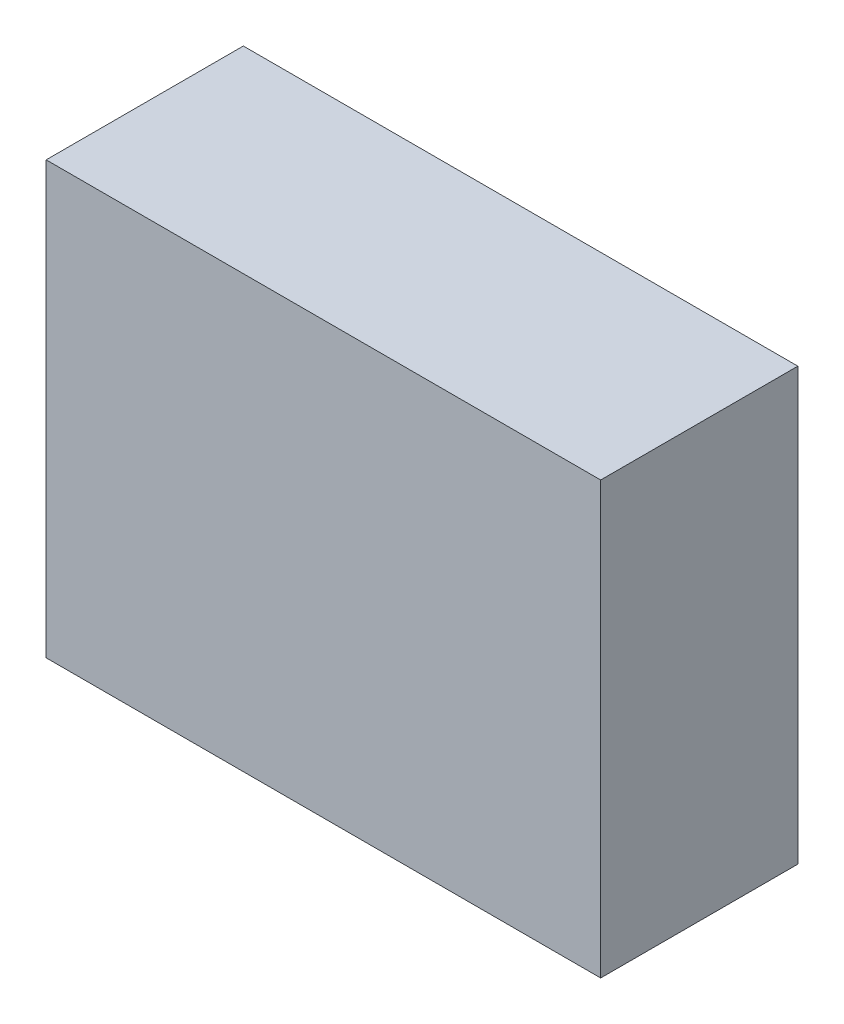
ISO-10303-21;
HEADER;
FILE_DESCRIPTION(('STEP AP214'),'2;1');
FILE_NAME('part.step','',(''),(''),'','','');
FILE_SCHEMA(('AUTOMOTIVE_DESIGN { 1 0 10303 214 1 1 1 1 }'));
ENDSEC;
DATA;
#1=APPLICATION_CONTEXT('core data for automotive mechanical design processes');
#2=APPLICATION_PROTOCOL_DEFINITION('international standard','automotive_design',2000,#1);
#3=PRODUCT_CONTEXT('',#1,'mechanical');
#4=PRODUCT('Part','Part','',(#3));
#5=PRODUCT_RELATED_PRODUCT_CATEGORY('part','',(#4));
#6=PRODUCT_DEFINITION_FORMATION('','',#4);
#7=PRODUCT_DEFINITION_CONTEXT('part definition',#1,'design');
#8=PRODUCT_DEFINITION('design','',#6,#7);
#9=PRODUCT_DEFINITION_SHAPE('','',#8);
#10=(LENGTH_UNIT() NAMED_UNIT(*) SI_UNIT(.MILLI.,.METRE.));
#11=(NAMED_UNIT(*) PLANE_ANGLE_UNIT() SI_UNIT($,.RADIAN.));
#12=(NAMED_UNIT(*) SI_UNIT($,.STERADIAN.) SOLID_ANGLE_UNIT());
#13=UNCERTAINTY_MEASURE_WITH_UNIT(LENGTH_MEASURE(1.E-05),#10,'distance_accuracy_value','');
#14=(GEOMETRIC_REPRESENTATION_CONTEXT(3) GLOBAL_UNCERTAINTY_ASSIGNED_CONTEXT((#13)) GLOBAL_UNIT_ASSIGNED_CONTEXT((#10,
#11,#12)) REPRESENTATION_CONTEXT('',''));
#15=CARTESIAN_POINT('',(0.,0.,0.));
#16=DIRECTION('',(0.,0.,1.));
#17=DIRECTION('',(1.,0.,0.));
#18=AXIS2_PLACEMENT_3D('',#15,#16,#17);
#19=CARTESIAN_POINT('',(225.,175.,160.));
#20=DIRECTION('',(-1.,0.,0.));
#21=DIRECTION('',(0.,0.,1.));
#22=AXIS2_PLACEMENT_3D('',#19,#20,#21);
#23=PLANE('',#22);
#24=DIRECTION('',(0.,1.,0.));
#25=VECTOR('',#24,1.);
#26=CARTESIAN_POINT('',(225.,175.,0.));
#27=LINE('',#26,#25);
#28=CARTESIAN_POINT('',(225.,-175.,0.));
#29=VERTEX_POINT('',#28);
#30=CARTESIAN_POINT('',(225.,175.,0.));
#31=VERTEX_POINT('',#30);
#32=EDGE_CURVE('E107',#29,#31,#27,.T.);
#33=ORIENTED_EDGE('',*,*,#32,.T.);
#34=DIRECTION('',(0.,0.,-1.));
#35=VECTOR('',#34,1.);
#36=CARTESIAN_POINT('',(225.,175.,160.));
#37=LINE('',#36,#35);
#38=CARTESIAN_POINT('',(225.,175.,160.));
#39=VERTEX_POINT('',#38);
#40=EDGE_CURVE('E11',#39,#31,#37,.T.);
#41=ORIENTED_EDGE('',*,*,#40,.F.);
#42=DIRECTION('',(0.,1.,0.));
#43=VECTOR('',#42,1.);
#44=CARTESIAN_POINT('',(225.,175.,160.));
#45=LINE('',#44,#43);
#46=CARTESIAN_POINT('',(225.,-175.,160.));
#47=VERTEX_POINT('',#46);
#48=EDGE_CURVE('E91',#47,#39,#45,.T.);
#49=ORIENTED_EDGE('',*,*,#48,.F.);
#50=DIRECTION('',(0.,0.,-1.));
#51=VECTOR('',#50,1.);
#52=CARTESIAN_POINT('',(225.,-175.,160.));
#53=LINE('',#52,#51);
#54=EDGE_CURVE('E103',#47,#29,#53,.T.);
#55=ORIENTED_EDGE('',*,*,#54,.T.);
#56=EDGE_LOOP('',(#33,#41,#49,#55));
#57=FACE_BOUND('',#56,.T.);
#58=ADVANCED_FACE('F39',(#57),#23,.F.);
#59=CARTESIAN_POINT('',(-225.,175.,160.));
#60=DIRECTION('',(0.,-1.,0.));
#61=DIRECTION('',(0.,0.,-1.));
#62=AXIS2_PLACEMENT_3D('',#59,#60,#61);
#63=PLANE('',#62);
#64=DIRECTION('',(-1.,0.,0.));
#65=VECTOR('',#64,1.);
#66=CARTESIAN_POINT('',(-225.,175.,0.));
#67=LINE('',#66,#65);
#68=CARTESIAN_POINT('',(-225.,175.,0.));
#69=VERTEX_POINT('',#68);
#70=EDGE_CURVE('E96',#31,#69,#67,.T.);
#71=ORIENTED_EDGE('',*,*,#70,.T.);
#72=DIRECTION('',(0.,0.,-1.));
#73=VECTOR('',#72,1.);
#74=CARTESIAN_POINT('',(-225.,175.,160.));
#75=LINE('',#74,#73);
#76=CARTESIAN_POINT('',(-225.,175.,160.));
#77=VERTEX_POINT('',#76);
#78=EDGE_CURVE('E48',#77,#69,#75,.T.);
#79=ORIENTED_EDGE('',*,*,#78,.F.);
#80=DIRECTION('',(-1.,0.,0.));
#81=VECTOR('',#80,1.);
#82=CARTESIAN_POINT('',(-225.,175.,160.));
#83=LINE('',#82,#81);
#84=EDGE_CURVE('E86',#39,#77,#83,.T.);
#85=ORIENTED_EDGE('',*,*,#84,.F.);
#86=ORIENTED_EDGE('',*,*,#40,.T.);
#87=EDGE_LOOP('',(#71,#79,#85,#86));
#88=FACE_BOUND('',#87,.T.);
#89=ADVANCED_FACE('F95',(#88),#63,.F.);
#90=CARTESIAN_POINT('',(-225.,175.,160.));
#91=DIRECTION('',(1.,0.,0.));
#92=DIRECTION('',(0.,0.,-1.));
#93=AXIS2_PLACEMENT_3D('',#90,#91,#92);
#94=PLANE('',#93);
#95=DIRECTION('',(0.,-1.,0.));
#96=VECTOR('',#95,1.);
#97=CARTESIAN_POINT('',(-225.,175.,0.));
#98=LINE('',#97,#96);
#99=CARTESIAN_POINT('',(-225.,-175.,0.));
#100=VERTEX_POINT('',#99);
#101=EDGE_CURVE('E73',#69,#100,#98,.T.);
#102=ORIENTED_EDGE('',*,*,#101,.T.);
#103=DIRECTION('',(0.,0.,-1.));
#104=VECTOR('',#103,1.);
#105=CARTESIAN_POINT('',(-225.,-175.,160.));
#106=LINE('',#105,#104);
#107=CARTESIAN_POINT('',(-225.,-175.,160.));
#108=VERTEX_POINT('',#107);
#109=EDGE_CURVE('E98',#108,#100,#106,.T.);
#110=ORIENTED_EDGE('',*,*,#109,.F.);
#111=DIRECTION('',(0.,-1.,0.));
#112=VECTOR('',#111,1.);
#113=CARTESIAN_POINT('',(-225.,175.,160.));
#114=LINE('',#113,#112);
#115=EDGE_CURVE('E89',#77,#108,#114,.T.);
#116=ORIENTED_EDGE('',*,*,#115,.F.);
#117=ORIENTED_EDGE('',*,*,#78,.T.);
#118=EDGE_LOOP('',(#102,#110,#116,#117));
#119=FACE_BOUND('',#118,.T.);
#120=ADVANCED_FACE('F99',(#119),#94,.F.);
#121=CARTESIAN_POINT('',(-225.,-175.,160.));
#122=DIRECTION('',(0.,1.,0.));
#123=DIRECTION('',(0.,0.,1.));
#124=AXIS2_PLACEMENT_3D('',#121,#122,#123);
#125=PLANE('',#124);
#126=DIRECTION('',(1.,0.,0.));
#127=VECTOR('',#126,1.);
#128=CARTESIAN_POINT('',(-225.,-175.,0.));
#129=LINE('',#128,#127);
#130=EDGE_CURVE('E79',#100,#29,#129,.T.);
#131=ORIENTED_EDGE('',*,*,#130,.T.);
#132=ORIENTED_EDGE('',*,*,#54,.F.);
#133=DIRECTION('',(1.,0.,0.));
#134=VECTOR('',#133,1.);
#135=CARTESIAN_POINT('',(-225.,-175.,160.));
#136=LINE('',#135,#134);
#137=EDGE_CURVE('E56',#108,#47,#136,.T.);
#138=ORIENTED_EDGE('',*,*,#137,.F.);
#139=ORIENTED_EDGE('',*,*,#109,.T.);
#140=EDGE_LOOP('',(#131,#132,#138,#139));
#141=FACE_BOUND('',#140,.T.);
#142=ADVANCED_FACE('F120',(#141),#125,.F.);
#143=CARTESIAN_POINT('',(0.,0.,160.));
#144=DIRECTION('',(0.,0.,1.));
#145=DIRECTION('',(1.,0.,0.));
#146=AXIS2_PLACEMENT_3D('',#143,#144,#145);
#147=PLANE('',#146);
#148=ORIENTED_EDGE('',*,*,#48,.T.);
#149=ORIENTED_EDGE('',*,*,#84,.T.);
#150=ORIENTED_EDGE('',*,*,#115,.T.);
#151=ORIENTED_EDGE('',*,*,#137,.T.);
#152=EDGE_LOOP('',(#148,#149,#150,#151));
#153=FACE_BOUND('',#152,.T.);
#154=ADVANCED_FACE('F87',(#153),#147,.T.);
#155=CARTESIAN_POINT('',(0.,0.,0.));
#156=DIRECTION('',(0.,0.,1.));
#157=DIRECTION('',(1.,0.,0.));
#158=AXIS2_PLACEMENT_3D('',#155,#156,#157);
#159=PLANE('',#158);
#160=ORIENTED_EDGE('',*,*,#32,.F.);
#161=ORIENTED_EDGE('',*,*,#130,.F.);
#162=ORIENTED_EDGE('',*,*,#101,.F.);
#163=ORIENTED_EDGE('',*,*,#70,.F.);
#164=EDGE_LOOP('',(#160,#161,#162,#163));
#165=FACE_BOUND('',#164,.T.);
#166=ADVANCED_FACE('F123',(#165),#159,.F.);
#167=CLOSED_SHELL('',(#58,#89,#120,#142,#154,#166));
#168=MANIFOLD_SOLID_BREP('B2',#167);
#169=ADVANCED_BREP_SHAPE_REPRESENTATION('',(#18,#168),#14);
#170=SHAPE_DEFINITION_REPRESENTATION(#9,#169);
ENDSEC;
END-ISO-10303-21;
